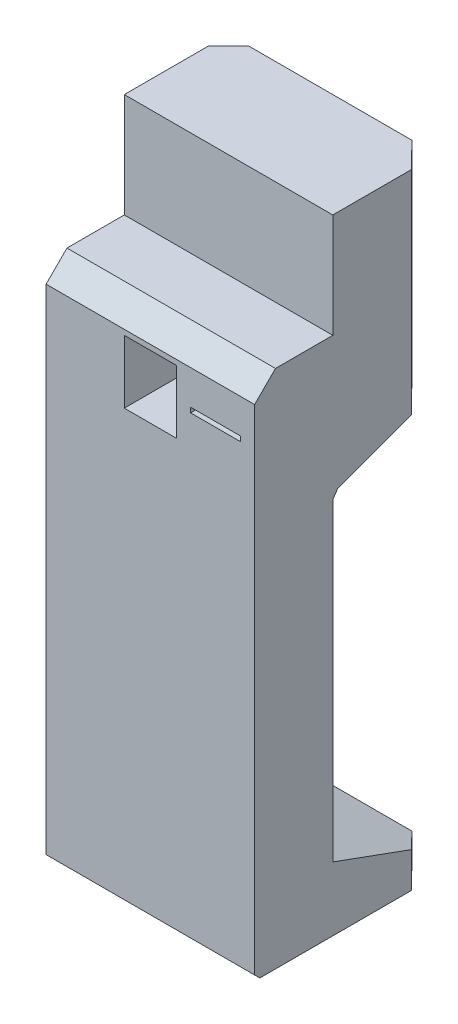
ISO-10303-21;
HEADER;
FILE_DESCRIPTION(('STEP AP214'),'2;1');
FILE_NAME('part.step','',(''),(''),'','','');
FILE_SCHEMA(('AUTOMOTIVE_DESIGN { 1 0 10303 214 1 1 1 1 }'));
ENDSEC;
DATA;
#1=APPLICATION_CONTEXT('core data for automotive mechanical design processes');
#2=APPLICATION_PROTOCOL_DEFINITION('international standard','automotive_design',2000,#1);
#3=PRODUCT_CONTEXT('',#1,'mechanical');
#4=PRODUCT('Part','Part','',(#3));
#5=PRODUCT_RELATED_PRODUCT_CATEGORY('part','',(#4));
#6=PRODUCT_DEFINITION_FORMATION('','',#4);
#7=PRODUCT_DEFINITION_CONTEXT('part definition',#1,'design');
#8=PRODUCT_DEFINITION('design','',#6,#7);
#9=PRODUCT_DEFINITION_SHAPE('','',#8);
#10=(LENGTH_UNIT() NAMED_UNIT(*) SI_UNIT(.MILLI.,.METRE.));
#11=(NAMED_UNIT(*) PLANE_ANGLE_UNIT() SI_UNIT($,.RADIAN.));
#12=(NAMED_UNIT(*) SI_UNIT($,.STERADIAN.) SOLID_ANGLE_UNIT());
#13=UNCERTAINTY_MEASURE_WITH_UNIT(LENGTH_MEASURE(1.E-05),#10,'distance_accuracy_value','');
#14=(GEOMETRIC_REPRESENTATION_CONTEXT(3) GLOBAL_UNCERTAINTY_ASSIGNED_CONTEXT((#13)) GLOBAL_UNIT_ASSIGNED_CONTEXT((#10,
#11,#12)) REPRESENTATION_CONTEXT('',''));
#15=CARTESIAN_POINT('',(0.,0.,0.));
#16=DIRECTION('',(0.,0.,1.));
#17=DIRECTION('',(1.,0.,0.));
#18=AXIS2_PLACEMENT_3D('',#15,#16,#17);
#19=CARTESIAN_POINT('',(400.,50.,0.));
#20=DIRECTION('',(0.,0.,1.));
#21=DIRECTION('',(0.,-1.,0.));
#22=AXIS2_PLACEMENT_3D('',#19,#20,#21);
#23=PLANE('',#22);
#24=DIRECTION('',(-1.,0.,0.));
#25=VECTOR('',#24,1.);
#26=CARTESIAN_POINT('',(400.,0.,0.));
#27=LINE('',#26,#25);
#28=CARTESIAN_POINT('',(351.734705208214,0.,0.));
#29=VERTEX_POINT('',#28);
#30=CARTESIAN_POINT('',(38.6420778551322,0.,0.));
#31=VERTEX_POINT('',#30);
#32=EDGE_CURVE('E281',#29,#31,#27,.T.);
#33=ORIENTED_EDGE('',*,*,#32,.T.);
#34=DIRECTION('',(0.,1.,0.));
#35=VECTOR('',#34,1.);
#36=CARTESIAN_POINT('',(38.6420778551322,50.0000000000001,0.));
#37=LINE('',#36,#35);
#38=CARTESIAN_POINT('',(38.6420778551323,50.,0.));
#39=VERTEX_POINT('',#38);
#40=EDGE_CURVE('E367',#31,#39,#37,.T.);
#41=ORIENTED_EDGE('',*,*,#40,.T.);
#42=DIRECTION('',(-1.,0.,0.));
#43=VECTOR('',#42,1.);
#44=CARTESIAN_POINT('',(400.,50.,0.));
#45=LINE('',#44,#43);
#46=CARTESIAN_POINT('',(351.734705208214,50.,0.));
#47=VERTEX_POINT('',#46);
#48=EDGE_CURVE('E248',#47,#39,#45,.T.);
#49=ORIENTED_EDGE('',*,*,#48,.F.);
#50=DIRECTION('',(0.,-1.,0.));
#51=VECTOR('',#50,1.);
#52=CARTESIAN_POINT('',(351.734705208214,50.,0.));
#53=LINE('',#52,#51);
#54=EDGE_CURVE('E368',#47,#29,#53,.T.);
#55=ORIENTED_EDGE('',*,*,#54,.T.);
#56=EDGE_LOOP('',(#33,#41,#49,#55));
#57=FACE_BOUND('',#56,.T.);
#58=ADVANCED_FACE('F33',(#57),#23,.F.);
#59=CARTESIAN_POINT('',(400.,50.,0.));
#60=DIRECTION('',(0.,-0.939692620785907,0.342020143325673));
#61=DIRECTION('',(0.,-0.342020143325673,-0.939692620785907));
#62=AXIS2_PLACEMENT_3D('',#59,#60,#61);
#63=PLANE('',#62);
#64=ORIENTED_EDGE('',*,*,#48,.T.);
#65=DIRECTION('',(-0.678775971324876,0.251160922277194,0.69005896260598));
#66=VECTOR('',#65,1.);
#67=CARTESIAN_POINT('',(205.132977514235,-11.6050209136324,-169.258403885233));
#68=LINE('',#67,#66);
#69=CARTESIAN_POINT('',(0.,64.2983551610683,39.284407940377));
#70=VERTEX_POINT('',#69);
#71=EDGE_CURVE('E376',#39,#70,#68,.T.);
#72=ORIENTED_EDGE('',*,*,#71,.T.);
#73=DIRECTION('',(0.,0.342020143325673,0.939692620785907));
#74=VECTOR('',#73,1.);
#75=CARTESIAN_POINT('',(0.,50.,0.));
#76=LINE('',#75,#74);
#77=CARTESIAN_POINT('',(0.,122.794046853241,200.));
#78=VERTEX_POINT('',#77);
#79=EDGE_CURVE('E282',#70,#78,#76,.T.);
#80=ORIENTED_EDGE('',*,*,#79,.T.);
#81=DIRECTION('',(-1.,0.,0.));
#82=VECTOR('',#81,1.);
#83=CARTESIAN_POINT('',(400.,122.794046853241,200.));
#84=LINE('',#83,#82);
#85=CARTESIAN_POINT('',(400.,122.794046853241,200.));
#86=VERTEX_POINT('',#85);
#87=EDGE_CURVE('E245',#86,#78,#84,.T.);
#88=ORIENTED_EDGE('',*,*,#87,.F.);
#89=DIRECTION('',(0.,0.342020143325673,0.939692620785907));
#90=VECTOR('',#89,1.);
#91=CARTESIAN_POINT('',(400.,50.,0.));
#92=LINE('',#91,#90);
#93=CARTESIAN_POINT('',(400.,67.8591412572024,49.0675873350135));
#94=VERTEX_POINT('',#93);
#95=EDGE_CURVE('E308',#94,#86,#92,.T.);
#96=ORIENTED_EDGE('',*,*,#95,.F.);
#97=DIRECTION('',(-0.678775971324876,-0.251160922277194,-0.690058962605979));
#98=VECTOR('',#97,1.);
#99=CARTESIAN_POINT('',(373.97230361065,58.2283639373447,22.607244116909));
#100=LINE('',#99,#98);
#101=EDGE_CURVE('E55',#94,#47,#100,.T.);
#102=ORIENTED_EDGE('',*,*,#101,.T.);
#103=EDGE_LOOP('',(#64,#72,#80,#88,#96,#102));
#104=FACE_BOUND('',#103,.T.);
#105=ADVANCED_FACE('F356',(#104),#63,.F.);
#106=CARTESIAN_POINT('',(400.,724.969611738019,200.));
#107=DIRECTION('',(0.,0.,1.));
#108=DIRECTION('',(0.,-1.,0.));
#109=AXIS2_PLACEMENT_3D('',#106,#107,#108);
#110=PLANE('',#109);
#111=DIRECTION('',(0.,1.,0.));
#112=VECTOR('',#111,1.);
#113=CARTESIAN_POINT('',(0.,724.969611738019,200.));
#114=LINE('',#113,#112);
#115=CARTESIAN_POINT('',(0.,724.969611738019,200.));
#116=VERTEX_POINT('',#115);
#117=EDGE_CURVE('E284',#78,#116,#114,.T.);
#118=ORIENTED_EDGE('',*,*,#117,.T.);
#119=DIRECTION('',(-1.,0.,0.));
#120=VECTOR('',#119,1.);
#121=CARTESIAN_POINT('',(400.,724.969611738019,200.));
#122=LINE('',#121,#120);
#123=CARTESIAN_POINT('',(400.,724.969611738019,200.));
#124=VERTEX_POINT('',#123);
#125=EDGE_CURVE('E242',#124,#116,#122,.T.);
#126=ORIENTED_EDGE('',*,*,#125,.F.);
#127=DIRECTION('',(0.,1.,0.));
#128=VECTOR('',#127,1.);
#129=CARTESIAN_POINT('',(400.,724.969611738019,200.));
#130=LINE('',#129,#128);
#131=EDGE_CURVE('E456',#86,#124,#130,.T.);
#132=ORIENTED_EDGE('',*,*,#131,.F.);
#133=ORIENTED_EDGE('',*,*,#87,.T.);
#134=EDGE_LOOP('',(#118,#126,#132,#133));
#135=FACE_BOUND('',#134,.T.);
#136=ADVANCED_FACE('F361',(#135),#110,.F.);
#137=CARTESIAN_POINT('',(400.,738.389813171275,190.603073792141));
#138=DIRECTION('',(0.,0.573576436351044,0.819152044288993));
#139=DIRECTION('',(0.,-0.819152044288993,0.573576436351044));
#140=AXIS2_PLACEMENT_3D('',#137,#138,#139);
#141=PLANE('',#140);
#142=DIRECTION('',(0.,0.819152044288993,-0.573576436351044));
#143=VECTOR('',#142,1.);
#144=CARTESIAN_POINT('',(0.,738.389813171275,190.603073792141));
#145=LINE('',#144,#143);
#146=CARTESIAN_POINT('',(0.,738.389813171275,190.603073792141));
#147=VERTEX_POINT('',#146);
#148=EDGE_CURVE('E287',#116,#147,#145,.T.);
#149=ORIENTED_EDGE('',*,*,#148,.T.);
#150=DIRECTION('',(-1.,0.,0.));
#151=VECTOR('',#150,1.);
#152=CARTESIAN_POINT('',(400.,738.389813171275,190.603073792141));
#153=LINE('',#152,#151);
#154=CARTESIAN_POINT('',(400.,738.389813171275,190.603073792141));
#155=VERTEX_POINT('',#154);
#156=EDGE_CURVE('E239',#155,#147,#153,.T.);
#157=ORIENTED_EDGE('',*,*,#156,.F.);
#158=DIRECTION('',(0.,0.819152044288993,-0.573576436351044));
#159=VECTOR('',#158,1.);
#160=CARTESIAN_POINT('',(400.,738.389813171275,190.603073792141));
#161=LINE('',#160,#159);
#162=EDGE_CURVE('E268',#124,#155,#161,.T.);
#163=ORIENTED_EDGE('',*,*,#162,.F.);
#164=ORIENTED_EDGE('',*,*,#125,.T.);
#165=EDGE_LOOP('',(#149,#157,#163,#164));
#166=FACE_BOUND('',#165,.T.);
#167=ADVANCED_FACE('F462',(#166),#141,.F.);
#168=CARTESIAN_POINT('',(400.,804.343457158002,9.39692620785916));
#169=DIRECTION('',(0.,0.939692620785909,0.342020143325667));
#170=DIRECTION('',(0.,-0.342020143325667,0.939692620785909));
#171=AXIS2_PLACEMENT_3D('',#168,#169,#170);
#172=PLANE('',#171);
#173=DIRECTION('',(0.,0.342020143325667,-0.939692620785909));
#174=VECTOR('',#173,1.);
#175=CARTESIAN_POINT('',(0.,804.343457158002,9.39692620785916));
#176=LINE('',#175,#174);
#177=CARTESIAN_POINT('',(0.,793.465303430191,39.284407940377));
#178=VERTEX_POINT('',#177);
#179=EDGE_CURVE('E290',#147,#178,#176,.T.);
#180=ORIENTED_EDGE('',*,*,#179,.T.);
#181=DIRECTION('',(0.678775971324877,0.25116092227719,-0.69005896260598));
#182=VECTOR('',#181,1.);
#183=CARTESIAN_POINT('',(200.148417326644,867.52429080118,-164.190987569091));
#184=LINE('',#183,#182);
#185=CARTESIAN_POINT('',(29.3987985705332,804.343457158002,9.39692620785915));
#186=VERTEX_POINT('',#185);
#187=EDGE_CURVE('E213',#178,#186,#184,.T.);
#188=ORIENTED_EDGE('',*,*,#187,.T.);
#189=DIRECTION('',(-1.,0.,0.));
#190=VECTOR('',#189,1.);
#191=CARTESIAN_POINT('',(400.,804.343457158002,9.39692620785916));
#192=LINE('',#191,#190);
#193=CARTESIAN_POINT('',(360.977984492813,804.343457158002,9.39692620785916));
#194=VERTEX_POINT('',#193);
#195=EDGE_CURVE('E230',#194,#186,#192,.T.);
#196=ORIENTED_EDGE('',*,*,#195,.F.);
#197=DIRECTION('',(0.678775971324877,-0.25116092227719,0.69005896260598));
#198=VECTOR('',#197,1.);
#199=CARTESIAN_POINT('',(378.956863798241,797.690905950204,27.6746604330507));
#200=LINE('',#199,#198);
#201=CARTESIAN_POINT('',(400.,789.904517334057,49.0675873350135));
#202=VERTEX_POINT('',#201);
#203=EDGE_CURVE('E382',#194,#202,#200,.T.);
#204=ORIENTED_EDGE('',*,*,#203,.T.);
#205=DIRECTION('',(0.,0.342020143325667,-0.939692620785909));
#206=VECTOR('',#205,1.);
#207=CARTESIAN_POINT('',(400.,797.763658591259,27.4747741945463));
#208=LINE('',#207,#206);
#209=EDGE_CURVE('E261',#155,#202,#208,.T.);
#210=ORIENTED_EDGE('',*,*,#209,.F.);
#211=ORIENTED_EDGE('',*,*,#156,.T.);
#212=EDGE_LOOP('',(#180,#188,#196,#204,#210,#211));
#213=FACE_BOUND('',#212,.T.);
#214=ADVANCED_FACE('F465',(#213),#172,.F.);
#215=CARTESIAN_POINT('',(400.,817.763658591259,0.));
#216=DIRECTION('',(0.,0.573576436351051,0.819152044288988));
#217=DIRECTION('',(0.,-0.819152044288988,0.573576436351051));
#218=AXIS2_PLACEMENT_3D('',#215,#216,#217);
#219=PLANE('',#218);
#220=ORIENTED_EDGE('',*,*,#195,.T.);
#221=DIRECTION('',(0.491384255613947,0.7134346467771,-0.499552317693314));
#222=VECTOR('',#221,1.);
#223=CARTESIAN_POINT('',(125.89501488074,944.445105129168,-88.7033038171558));
#224=LINE('',#223,#222);
#225=CARTESIAN_POINT('',(38.6420778551323,817.763658591259,0.));
#226=VERTEX_POINT('',#225);
#227=EDGE_CURVE('E224',#186,#226,#224,.T.);
#228=ORIENTED_EDGE('',*,*,#227,.T.);
#229=DIRECTION('',(-1.,0.,0.));
#230=VECTOR('',#229,1.);
#231=CARTESIAN_POINT('',(400.,817.763658591259,0.));
#232=LINE('',#231,#230);
#233=CARTESIAN_POINT('',(351.734705208214,817.763658591259,0.));
#234=VERTEX_POINT('',#233);
#235=EDGE_CURVE('E222',#234,#226,#232,.T.);
#236=ORIENTED_EDGE('',*,*,#235,.F.);
#237=DIRECTION('',(0.491384255613947,-0.7134346467771,0.499552317693314));
#238=VECTOR('',#237,1.);
#239=CARTESIAN_POINT('',(363.388770247092,800.843267513321,11.8477853822285));
#240=LINE('',#239,#238);
#241=EDGE_CURVE('E384',#234,#194,#240,.T.);
#242=ORIENTED_EDGE('',*,*,#241,.T.);
#243=EDGE_LOOP('',(#220,#228,#236,#242));
#244=FACE_BOUND('',#243,.T.);
#245=ADVANCED_FACE('F470',(#244),#219,.F.);
#246=CARTESIAN_POINT('',(400.,997.763658591259,0.));
#247=DIRECTION('',(0.,0.,1.));
#248=DIRECTION('',(0.,-1.,0.));
#249=AXIS2_PLACEMENT_3D('',#246,#247,#248);
#250=PLANE('',#249);
#251=ORIENTED_EDGE('',*,*,#235,.T.);
#252=DIRECTION('',(0.,1.,0.));
#253=VECTOR('',#252,1.);
#254=CARTESIAN_POINT('',(38.6420778551322,997.763658591259,0.));
#255=LINE('',#254,#253);
#256=CARTESIAN_POINT('',(38.6420778551323,1197.76365859126,0.));
#257=VERTEX_POINT('',#256);
#258=EDGE_CURVE('E206',#226,#257,#255,.T.);
#259=ORIENTED_EDGE('',*,*,#258,.T.);
#260=DIRECTION('',(-1.,0.,0.));
#261=VECTOR('',#260,1.);
#262=CARTESIAN_POINT('',(400.,1197.76365859126,0.));
#263=LINE('',#262,#261);
#264=CARTESIAN_POINT('',(351.734705208214,1197.76365859126,0.));
#265=VERTEX_POINT('',#264);
#266=EDGE_CURVE('E220',#265,#257,#263,.T.);
#267=ORIENTED_EDGE('',*,*,#266,.F.);
#268=DIRECTION('',(0.,-1.,0.));
#269=VECTOR('',#268,1.);
#270=CARTESIAN_POINT('',(351.734705208214,997.763658591259,0.));
#271=LINE('',#270,#269);
#272=EDGE_CURVE('E387',#265,#234,#271,.T.);
#273=ORIENTED_EDGE('',*,*,#272,.T.);
#274=EDGE_LOOP('',(#251,#259,#267,#273));
#275=FACE_BOUND('',#274,.T.);
#276=ADVANCED_FACE('F218',(#275),#250,.F.);
#277=CARTESIAN_POINT('',(400.,1197.76365859126,200.));
#278=DIRECTION('',(0.,-1.,0.));
#279=DIRECTION('',(0.,0.,-1.));
#280=AXIS2_PLACEMENT_3D('',#277,#278,#279);
#281=PLANE('',#280);
#282=ORIENTED_EDGE('',*,*,#266,.T.);
#283=DIRECTION('',(-0.701254440401762,0.,0.712911081283502));
#284=VECTOR('',#283,1.);
#285=CARTESIAN_POINT('',(-32.9719100035619,1197.76365859126,72.804395349162));
#286=LINE('',#285,#284);
#287=CARTESIAN_POINT('',(0.,1197.76365859126,39.284407940377));
#288=VERTEX_POINT('',#287);
#289=EDGE_CURVE('E203',#257,#288,#286,.T.);
#290=ORIENTED_EDGE('',*,*,#289,.T.);
#291=DIRECTION('',(0.,0.,1.));
#292=VECTOR('',#291,1.);
#293=CARTESIAN_POINT('',(0.,1197.76365859126,200.));
#294=LINE('',#293,#292);
#295=CARTESIAN_POINT('',(0.,1197.76365859126,200.));
#296=VERTEX_POINT('',#295);
#297=EDGE_CURVE('E293',#288,#296,#294,.T.);
#298=ORIENTED_EDGE('',*,*,#297,.T.);
#299=DIRECTION('',(-1.,0.,0.));
#300=VECTOR('',#299,1.);
#301=CARTESIAN_POINT('',(400.,1197.76365859126,200.));
#302=LINE('',#301,#300);
#303=CARTESIAN_POINT('',(400.,1197.76365859126,200.));
#304=VERTEX_POINT('',#303);
#305=EDGE_CURVE('E228',#304,#296,#302,.T.);
#306=ORIENTED_EDGE('',*,*,#305,.F.);
#307=DIRECTION('',(0.,0.,1.));
#308=VECTOR('',#307,1.);
#309=CARTESIAN_POINT('',(400.,1197.76365859126,0.));
#310=LINE('',#309,#308);
#311=CARTESIAN_POINT('',(400.,1197.76365859126,49.0675873350135));
#312=VERTEX_POINT('',#311);
#313=EDGE_CURVE('E258',#312,#304,#310,.T.);
#314=ORIENTED_EDGE('',*,*,#313,.F.);
#315=DIRECTION('',(-0.701254440401762,0.,-0.712911081283502));
#316=VECTOR('',#315,1.);
#317=CARTESIAN_POINT('',(322.648629758769,1197.76365859126,-29.5695603539813));
#318=LINE('',#317,#316);
#319=EDGE_CURVE('E47',#312,#265,#318,.T.);
#320=ORIENTED_EDGE('',*,*,#319,.T.);
#321=EDGE_LOOP('',(#282,#290,#298,#306,#314,#320));
#322=FACE_BOUND('',#321,.T.);
#323=ADVANCED_FACE('F226',(#322),#281,.F.);
#324=CARTESIAN_POINT('',(400.,997.763658591259,200.));
#325=DIRECTION('',(0.,0.,-1.));
#326=DIRECTION('',(-1.,0.,0.));
#327=AXIS2_PLACEMENT_3D('',#324,#325,#326);
#328=PLANE('',#327);
#329=DIRECTION('',(0.,-1.,0.));
#330=VECTOR('',#329,1.);
#331=CARTESIAN_POINT('',(0.,997.763658591259,200.));
#332=LINE('',#331,#330);
#333=CARTESIAN_POINT('',(0.,997.763658591259,200.));
#334=VERTEX_POINT('',#333);
#335=EDGE_CURVE('E295',#296,#334,#332,.T.);
#336=ORIENTED_EDGE('',*,*,#335,.T.);
#337=DIRECTION('',(-1.,0.,0.));
#338=VECTOR('',#337,1.);
#339=CARTESIAN_POINT('',(400.,997.763658591259,200.));
#340=LINE('',#339,#338);
#341=CARTESIAN_POINT('',(400.,997.763658591259,200.));
#342=VERTEX_POINT('',#341);
#343=EDGE_CURVE('E233',#342,#334,#340,.T.);
#344=ORIENTED_EDGE('',*,*,#343,.F.);
#345=DIRECTION('',(0.,-1.,0.));
#346=VECTOR('',#345,1.);
#347=CARTESIAN_POINT('',(400.,997.763658591259,200.));
#348=LINE('',#347,#346);
#349=EDGE_CURVE('E264',#304,#342,#348,.T.);
#350=ORIENTED_EDGE('',*,*,#349,.F.);
#351=ORIENTED_EDGE('',*,*,#305,.T.);
#352=EDGE_LOOP('',(#336,#344,#350,#351));
#353=FACE_BOUND('',#352,.T.);
#354=ADVANCED_FACE('F346',(#353),#328,.F.);
#355=CARTESIAN_POINT('',(400.,997.763658591259,310.));
#356=DIRECTION('',(0.,-1.,0.));
#357=DIRECTION('',(0.,0.,-1.));
#358=AXIS2_PLACEMENT_3D('',#355,#356,#357);
#359=PLANE('',#358);
#360=DIRECTION('',(0.,0.,1.));
#361=VECTOR('',#360,1.);
#362=CARTESIAN_POINT('',(0.,997.763658591259,310.));
#363=LINE('',#362,#361);
#364=CARTESIAN_POINT('',(0.,997.763658591259,310.));
#365=VERTEX_POINT('',#364);
#366=EDGE_CURVE('E297',#334,#365,#363,.T.);
#367=ORIENTED_EDGE('',*,*,#366,.T.);
#368=DIRECTION('',(-1.,0.,0.));
#369=VECTOR('',#368,1.);
#370=CARTESIAN_POINT('',(400.,997.763658591259,310.));
#371=LINE('',#370,#369);
#372=CARTESIAN_POINT('',(400.,997.763658591259,310.));
#373=VERTEX_POINT('',#372);
#374=EDGE_CURVE('E320',#373,#365,#371,.T.);
#375=ORIENTED_EDGE('',*,*,#374,.F.);
#376=DIRECTION('',(0.,0.,1.));
#377=VECTOR('',#376,1.);
#378=CARTESIAN_POINT('',(400.,997.763658591259,310.));
#379=LINE('',#378,#377);
#380=EDGE_CURVE('E266',#342,#373,#379,.T.);
#381=ORIENTED_EDGE('',*,*,#380,.F.);
#382=ORIENTED_EDGE('',*,*,#343,.T.);
#383=EDGE_LOOP('',(#367,#375,#381,#382));
#384=FACE_BOUND('',#383,.T.);
#385=ADVANCED_FACE('F327',(#384),#359,.F.);
#386=CARTESIAN_POINT('',(400.,997.763658591259,310.));
#387=DIRECTION('',(0.,-0.707106781186547,-0.707106781186549));
#388=DIRECTION('',(0.,0.707106781186549,-0.707106781186547));
#389=AXIS2_PLACEMENT_3D('',#386,#387,#388);
#390=PLANE('',#389);
#391=DIRECTION('',(0.,-0.707106781186549,0.707106781186547));
#392=VECTOR('',#391,1.);
#393=CARTESIAN_POINT('',(0.,997.763658591259,310.));
#394=LINE('',#393,#392);
#395=CARTESIAN_POINT('',(0.,957.763658591259,350.));
#396=VERTEX_POINT('',#395);
#397=EDGE_CURVE('E299',#365,#396,#394,.T.);
#398=ORIENTED_EDGE('',*,*,#397,.T.);
#399=DIRECTION('',(-1.,0.,0.));
#400=VECTOR('',#399,1.);
#401=CARTESIAN_POINT('',(400.,957.763658591259,350.));
#402=LINE('',#401,#400);
#403=CARTESIAN_POINT('',(400.,957.763658591259,350.));
#404=VERTEX_POINT('',#403);
#405=EDGE_CURVE('E317',#404,#396,#402,.T.);
#406=ORIENTED_EDGE('',*,*,#405,.F.);
#407=DIRECTION('',(0.,-0.707106781186549,0.707106781186547));
#408=VECTOR('',#407,1.);
#409=CARTESIAN_POINT('',(400.,997.763658591259,310.));
#410=LINE('',#409,#408);
#411=EDGE_CURVE('E273',#373,#404,#410,.T.);
#412=ORIENTED_EDGE('',*,*,#411,.F.);
#413=ORIENTED_EDGE('',*,*,#374,.T.);
#414=EDGE_LOOP('',(#398,#406,#412,#413));
#415=FACE_BOUND('',#414,.T.);
#416=ADVANCED_FACE('F338',(#415),#390,.F.);
#417=CARTESIAN_POINT('',(400.,9.99999999999996,350.));
#418=DIRECTION('',(0.,0.,-1.));
#419=DIRECTION('',(0.,1.,0.));
#420=AXIS2_PLACEMENT_3D('',#417,#418,#419);
#421=PLANE('',#420);
#422=DIRECTION('',(-1.,0.,0.));
#423=VECTOR('',#422,1.);
#424=CARTESIAN_POINT('',(372.65,891.963658591259,350.));
#425=LINE('',#424,#423);
#426=CARTESIAN_POINT('',(372.65,891.963658591259,350.));
#427=VERTEX_POINT('',#426);
#428=CARTESIAN_POINT('',(277.35,891.963658591259,350.));
#429=VERTEX_POINT('',#428);
#430=EDGE_CURVE('E408',#427,#429,#425,.T.);
#431=ORIENTED_EDGE('',*,*,#430,.F.);
#432=DIRECTION('',(0.,1.,0.));
#433=VECTOR('',#432,1.);
#434=CARTESIAN_POINT('',(372.65,891.963658591259,350.));
#435=LINE('',#434,#433);
#436=CARTESIAN_POINT('',(372.65,882.563658591259,350.));
#437=VERTEX_POINT('',#436);
#438=EDGE_CURVE('E392',#437,#427,#435,.T.);
#439=ORIENTED_EDGE('',*,*,#438,.F.);
#440=DIRECTION('',(1.,0.,0.));
#441=VECTOR('',#440,1.);
#442=CARTESIAN_POINT('',(372.65,882.563658591259,350.));
#443=LINE('',#442,#441);
#444=CARTESIAN_POINT('',(277.35,882.563658591259,350.));
#445=VERTEX_POINT('',#444);
#446=EDGE_CURVE('E397',#445,#437,#443,.T.);
#447=ORIENTED_EDGE('',*,*,#446,.F.);
#448=DIRECTION('',(0.,-1.,0.));
#449=VECTOR('',#448,1.);
#450=CARTESIAN_POINT('',(277.35,891.963658591259,350.));
#451=LINE('',#450,#449);
#452=EDGE_CURVE('E411',#429,#445,#451,.T.);
#453=ORIENTED_EDGE('',*,*,#452,.F.);
#454=EDGE_LOOP('',(#431,#439,#447,#453));
#455=FACE_BOUND('',#454,.T.);
#456=DIRECTION('',(1.,0.,0.));
#457=VECTOR('',#456,1.);
#458=CARTESIAN_POINT('',(150.,826.763658591259,350.));
#459=LINE('',#458,#457);
#460=CARTESIAN_POINT('',(150.,826.763658591259,350.));
#461=VERTEX_POINT('',#460);
#462=CARTESIAN_POINT('',(250.,826.763658591259,350.));
#463=VERTEX_POINT('',#462);
#464=EDGE_CURVE('E440',#461,#463,#459,.T.);
#465=ORIENTED_EDGE('',*,*,#464,.F.);
#466=DIRECTION('',(0.,-1.,0.));
#467=VECTOR('',#466,1.);
#468=CARTESIAN_POINT('',(150.,947.763658591259,350.));
#469=LINE('',#468,#467);
#470=CARTESIAN_POINT('',(150.,947.763658591259,350.));
#471=VERTEX_POINT('',#470);
#472=EDGE_CURVE('E418',#471,#461,#469,.T.);
#473=ORIENTED_EDGE('',*,*,#472,.F.);
#474=DIRECTION('',(-1.,0.,0.));
#475=VECTOR('',#474,1.);
#476=CARTESIAN_POINT('',(150.,947.763658591259,350.));
#477=LINE('',#476,#475);
#478=CARTESIAN_POINT('',(250.,947.763658591259,350.));
#479=VERTEX_POINT('',#478);
#480=EDGE_CURVE('E429',#479,#471,#477,.T.);
#481=ORIENTED_EDGE('',*,*,#480,.F.);
#482=DIRECTION('',(0.,1.,0.));
#483=VECTOR('',#482,1.);
#484=CARTESIAN_POINT('',(250.,947.763658591259,350.));
#485=LINE('',#484,#483);
#486=EDGE_CURVE('E443',#463,#479,#485,.T.);
#487=ORIENTED_EDGE('',*,*,#486,.F.);
#488=EDGE_LOOP('',(#465,#473,#481,#487));
#489=FACE_BOUND('',#488,.T.);
#490=DIRECTION('',(0.,-1.,0.));
#491=VECTOR('',#490,1.);
#492=CARTESIAN_POINT('',(0.,9.99999999999996,350.));
#493=LINE('',#492,#491);
#494=CARTESIAN_POINT('',(0.,9.99999999999996,350.));
#495=VERTEX_POINT('',#494);
#496=EDGE_CURVE('E301',#396,#495,#493,.T.);
#497=ORIENTED_EDGE('',*,*,#496,.T.);
#498=DIRECTION('',(-1.,0.,0.));
#499=VECTOR('',#498,1.);
#500=CARTESIAN_POINT('',(400.,9.99999999999996,350.));
#501=LINE('',#500,#499);
#502=CARTESIAN_POINT('',(400.,9.99999999999996,350.));
#503=VERTEX_POINT('',#502);
#504=EDGE_CURVE('E314',#503,#495,#501,.T.);
#505=ORIENTED_EDGE('',*,*,#504,.F.);
#506=DIRECTION('',(0.,-1.,0.));
#507=VECTOR('',#506,1.);
#508=CARTESIAN_POINT('',(400.,9.99999999999996,350.));
#509=LINE('',#508,#507);
#510=EDGE_CURVE('E275',#404,#503,#509,.T.);
#511=ORIENTED_EDGE('',*,*,#510,.F.);
#512=ORIENTED_EDGE('',*,*,#405,.T.);
#513=EDGE_LOOP('',(#497,#505,#511,#512));
#514=FACE_BOUND('',#513,.T.);
#515=ADVANCED_FACE('F342',(#455,#489,#514),#421,.F.);
#516=CARTESIAN_POINT('',(400.,0.,340.));
#517=DIRECTION('',(0.,0.707106781186548,-0.707106781186547));
#518=DIRECTION('',(0.,0.707106781186547,0.707106781186548));
#519=AXIS2_PLACEMENT_3D('',#516,#517,#518);
#520=PLANE('',#519);
#521=DIRECTION('',(0.,-0.707106781186547,-0.707106781186548));
#522=VECTOR('',#521,1.);
#523=CARTESIAN_POINT('',(0.,0.,340.));
#524=LINE('',#523,#522);
#525=CARTESIAN_POINT('',(0.,0.,340.));
#526=VERTEX_POINT('',#525);
#527=EDGE_CURVE('E303',#495,#526,#524,.T.);
#528=ORIENTED_EDGE('',*,*,#527,.T.);
#529=DIRECTION('',(-1.,0.,0.));
#530=VECTOR('',#529,1.);
#531=CARTESIAN_POINT('',(400.,0.,340.));
#532=LINE('',#531,#530);
#533=CARTESIAN_POINT('',(400.,0.,340.));
#534=VERTEX_POINT('',#533);
#535=EDGE_CURVE('E311',#534,#526,#532,.T.);
#536=ORIENTED_EDGE('',*,*,#535,.F.);
#537=DIRECTION('',(0.,-0.707106781186547,-0.707106781186548));
#538=VECTOR('',#537,1.);
#539=CARTESIAN_POINT('',(400.,0.,340.));
#540=LINE('',#539,#538);
#541=EDGE_CURVE('E277',#503,#534,#540,.T.);
#542=ORIENTED_EDGE('',*,*,#541,.F.);
#543=ORIENTED_EDGE('',*,*,#504,.T.);
#544=EDGE_LOOP('',(#528,#536,#542,#543));
#545=FACE_BOUND('',#544,.T.);
#546=ADVANCED_FACE('F535',(#545),#520,.F.);
#547=CARTESIAN_POINT('',(400.,0.,0.));
#548=DIRECTION('',(0.,1.,0.));
#549=DIRECTION('',(0.,0.,1.));
#550=AXIS2_PLACEMENT_3D('',#547,#548,#549);
#551=PLANE('',#550);
#552=DIRECTION('',(0.,0.,-1.));
#553=VECTOR('',#552,1.);
#554=CARTESIAN_POINT('',(0.,0.,0.));
#555=LINE('',#554,#553);
#556=CARTESIAN_POINT('',(0.,0.,39.284407940377));
#557=VERTEX_POINT('',#556);
#558=EDGE_CURVE('E305',#526,#557,#555,.T.);
#559=ORIENTED_EDGE('',*,*,#558,.T.);
#560=DIRECTION('',(0.701254440401762,0.,-0.712911081283502));
#561=VECTOR('',#560,1.);
#562=CARTESIAN_POINT('',(216.342651114281,0.,-180.654410907256));
#563=LINE('',#562,#561);
#564=EDGE_CURVE('E223',#557,#31,#563,.T.);
#565=ORIENTED_EDGE('',*,*,#564,.T.);
#566=ORIENTED_EDGE('',*,*,#32,.F.);
#567=DIRECTION('',(0.701254440401762,0.,0.712911081283502));
#568=VECTOR('',#567,1.);
#569=CARTESIAN_POINT('',(375.469539917563,0.,24.1293683174868));
#570=LINE('',#569,#568);
#571=CARTESIAN_POINT('',(400.,0.,49.0675873350135));
#572=VERTEX_POINT('',#571);
#573=EDGE_CURVE('E374',#29,#572,#570,.T.);
#574=ORIENTED_EDGE('',*,*,#573,.T.);
#575=DIRECTION('',(0.,0.,-1.));
#576=VECTOR('',#575,1.);
#577=CARTESIAN_POINT('',(400.,0.,0.));
#578=LINE('',#577,#576);
#579=EDGE_CURVE('E279',#534,#572,#578,.T.);
#580=ORIENTED_EDGE('',*,*,#579,.F.);
#581=ORIENTED_EDGE('',*,*,#535,.T.);
#582=EDGE_LOOP('',(#559,#565,#566,#574,#580,#581));
#583=FACE_BOUND('',#582,.T.);
#584=ADVANCED_FACE('F372',(#583),#551,.F.);
#585=CARTESIAN_POINT('',(400.,0.,0.));
#586=DIRECTION('',(-1.,0.,0.));
#587=DIRECTION('',(0.,0.,1.));
#588=AXIS2_PLACEMENT_3D('',#585,#586,#587);
#589=PLANE('',#588);
#590=ORIENTED_EDGE('',*,*,#579,.T.);
#591=DIRECTION('',(0.,1.,0.));
#592=VECTOR('',#591,1.);
#593=CARTESIAN_POINT('',(400.,0.,49.0675873350135));
#594=LINE('',#593,#592);
#595=EDGE_CURVE('E11',#572,#94,#594,.T.);
#596=ORIENTED_EDGE('',*,*,#595,.T.);
#597=ORIENTED_EDGE('',*,*,#95,.T.);
#598=ORIENTED_EDGE('',*,*,#131,.T.);
#599=ORIENTED_EDGE('',*,*,#162,.T.);
#600=ORIENTED_EDGE('',*,*,#209,.T.);
#601=EDGE_CURVE('E36',#202,#312,#594,.T.);
#602=ORIENTED_EDGE('',*,*,#601,.T.);
#603=ORIENTED_EDGE('',*,*,#313,.T.);
#604=ORIENTED_EDGE('',*,*,#349,.T.);
#605=ORIENTED_EDGE('',*,*,#380,.T.);
#606=ORIENTED_EDGE('',*,*,#411,.T.);
#607=ORIENTED_EDGE('',*,*,#510,.T.);
#608=ORIENTED_EDGE('',*,*,#541,.T.);
#609=EDGE_LOOP('',(#590,#596,#597,#598,#599,#600,#602,#603,#604,#605,#606,#607,#608));
#610=FACE_BOUND('',#609,.T.);
#611=ADVANCED_FACE('F257',(#610),#589,.F.);
#612=CARTESIAN_POINT('',(0.,0.,0.));
#613=DIRECTION('',(-1.,0.,0.));
#614=DIRECTION('',(0.,0.,1.));
#615=AXIS2_PLACEMENT_3D('',#612,#613,#614);
#616=PLANE('',#615);
#617=DIRECTION('',(0.,1.,0.));
#618=VECTOR('',#617,1.);
#619=CARTESIAN_POINT('',(0.,0.,39.284407940377));
#620=LINE('',#619,#618);
#621=EDGE_CURVE('E250',#557,#70,#620,.T.);
#622=ORIENTED_EDGE('',*,*,#621,.F.);
#623=ORIENTED_EDGE('',*,*,#558,.F.);
#624=ORIENTED_EDGE('',*,*,#527,.F.);
#625=ORIENTED_EDGE('',*,*,#496,.F.);
#626=ORIENTED_EDGE('',*,*,#397,.F.);
#627=ORIENTED_EDGE('',*,*,#366,.F.);
#628=ORIENTED_EDGE('',*,*,#335,.F.);
#629=ORIENTED_EDGE('',*,*,#297,.F.);
#630=EDGE_CURVE('E209',#178,#288,#620,.T.);
#631=ORIENTED_EDGE('',*,*,#630,.F.);
#632=ORIENTED_EDGE('',*,*,#179,.F.);
#633=ORIENTED_EDGE('',*,*,#148,.F.);
#634=ORIENTED_EDGE('',*,*,#117,.F.);
#635=ORIENTED_EDGE('',*,*,#79,.F.);
#636=EDGE_LOOP('',(#622,#623,#624,#625,#626,#627,#628,#629,#631,#632,#633,#634,#635));
#637=FACE_BOUND('',#636,.T.);
#638=ADVANCED_FACE('F333',(#637),#616,.T.);
#639=CARTESIAN_POINT('',(150.,947.763658591259,81.9999999999999));
#640=DIRECTION('',(-1.,0.,0.));
#641=DIRECTION('',(0.,-1.,0.));
#642=AXIS2_PLACEMENT_3D('',#639,#640,#641);
#643=PLANE('',#642);
#644=ORIENTED_EDGE('',*,*,#472,.T.);
#645=DIRECTION('',(0.,0.,1.));
#646=VECTOR('',#645,1.);
#647=CARTESIAN_POINT('',(150.,826.763658591259,81.9999999999999));
#648=LINE('',#647,#646);
#649=CARTESIAN_POINT('',(150.,826.763658591259,81.9999999999999));
#650=VERTEX_POINT('',#649);
#651=EDGE_CURVE('E438',#650,#461,#648,.T.);
#652=ORIENTED_EDGE('',*,*,#651,.F.);
#653=DIRECTION('',(0.,-1.,0.));
#654=VECTOR('',#653,1.);
#655=CARTESIAN_POINT('',(150.,947.763658591259,81.9999999999999));
#656=LINE('',#655,#654);
#657=CARTESIAN_POINT('',(150.,947.763658591259,81.9999999999999));
#658=VERTEX_POINT('',#657);
#659=EDGE_CURVE('E425',#658,#650,#656,.T.);
#660=ORIENTED_EDGE('',*,*,#659,.F.);
#661=DIRECTION('',(0.,0.,1.));
#662=VECTOR('',#661,1.);
#663=CARTESIAN_POINT('',(150.,947.763658591259,81.9999999999999));
#664=LINE('',#663,#662);
#665=EDGE_CURVE('E285',#658,#471,#664,.T.);
#666=ORIENTED_EDGE('',*,*,#665,.T.);
#667=EDGE_LOOP('',(#644,#652,#660,#666));
#668=FACE_BOUND('',#667,.T.);
#669=ADVANCED_FACE('F518',(#668),#643,.F.);
#670=CARTESIAN_POINT('',(150.,947.763658591259,81.9999999999999));
#671=DIRECTION('',(0.,1.,0.));
#672=DIRECTION('',(0.,0.,1.));
#673=AXIS2_PLACEMENT_3D('',#670,#671,#672);
#674=PLANE('',#673);
#675=ORIENTED_EDGE('',*,*,#480,.T.);
#676=ORIENTED_EDGE('',*,*,#665,.F.);
#677=DIRECTION('',(-1.,0.,0.));
#678=VECTOR('',#677,1.);
#679=CARTESIAN_POINT('',(150.,947.763658591259,81.9999999999999));
#680=LINE('',#679,#678);
#681=CARTESIAN_POINT('',(250.,947.763658591259,81.9999999999999));
#682=VERTEX_POINT('',#681);
#683=EDGE_CURVE('E435',#682,#658,#680,.T.);
#684=ORIENTED_EDGE('',*,*,#683,.F.);
#685=DIRECTION('',(0.,0.,1.));
#686=VECTOR('',#685,1.);
#687=CARTESIAN_POINT('',(250.,947.763658591259,81.9999999999999));
#688=LINE('',#687,#686);
#689=EDGE_CURVE('E449',#682,#479,#688,.T.);
#690=ORIENTED_EDGE('',*,*,#689,.T.);
#691=EDGE_LOOP('',(#675,#676,#684,#690));
#692=FACE_BOUND('',#691,.T.);
#693=ADVANCED_FACE('F514',(#692),#674,.F.);
#694=CARTESIAN_POINT('',(250.,947.763658591259,81.9999999999999));
#695=DIRECTION('',(1.,0.,0.));
#696=DIRECTION('',(0.,1.,0.));
#697=AXIS2_PLACEMENT_3D('',#694,#695,#696);
#698=PLANE('',#697);
#699=ORIENTED_EDGE('',*,*,#486,.T.);
#700=ORIENTED_EDGE('',*,*,#689,.F.);
#701=DIRECTION('',(0.,1.,0.));
#702=VECTOR('',#701,1.);
#703=CARTESIAN_POINT('',(250.,947.763658591259,81.9999999999999));
#704=LINE('',#703,#702);
#705=CARTESIAN_POINT('',(250.,826.763658591259,81.9999999999999));
#706=VERTEX_POINT('',#705);
#707=EDGE_CURVE('E432',#706,#682,#704,.T.);
#708=ORIENTED_EDGE('',*,*,#707,.F.);
#709=DIRECTION('',(0.,0.,1.));
#710=VECTOR('',#709,1.);
#711=CARTESIAN_POINT('',(250.,826.763658591259,81.9999999999999));
#712=LINE('',#711,#710);
#713=EDGE_CURVE('E451',#706,#463,#712,.T.);
#714=ORIENTED_EDGE('',*,*,#713,.T.);
#715=EDGE_LOOP('',(#699,#700,#708,#714));
#716=FACE_BOUND('',#715,.T.);
#717=ADVANCED_FACE('F517',(#716),#698,.F.);
#718=CARTESIAN_POINT('',(150.,826.763658591259,81.9999999999999));
#719=DIRECTION('',(0.,-1.,0.));
#720=DIRECTION('',(0.,0.,-1.));
#721=AXIS2_PLACEMENT_3D('',#718,#719,#720);
#722=PLANE('',#721);
#723=ORIENTED_EDGE('',*,*,#464,.T.);
#724=ORIENTED_EDGE('',*,*,#713,.F.);
#725=DIRECTION('',(1.,0.,0.));
#726=VECTOR('',#725,1.);
#727=CARTESIAN_POINT('',(150.,826.763658591259,81.9999999999999));
#728=LINE('',#727,#726);
#729=EDGE_CURVE('E428',#650,#706,#728,.T.);
#730=ORIENTED_EDGE('',*,*,#729,.F.);
#731=ORIENTED_EDGE('',*,*,#651,.T.);
#732=EDGE_LOOP('',(#723,#724,#730,#731));
#733=FACE_BOUND('',#732,.T.);
#734=ADVANCED_FACE('F512',(#733),#722,.F.);
#735=CARTESIAN_POINT('',(0.,0.,81.9999999999999));
#736=DIRECTION('',(0.,0.,1.));
#737=DIRECTION('',(1.,0.,0.));
#738=AXIS2_PLACEMENT_3D('',#735,#736,#737);
#739=PLANE('',#738);
#740=ORIENTED_EDGE('',*,*,#659,.T.);
#741=ORIENTED_EDGE('',*,*,#729,.T.);
#742=ORIENTED_EDGE('',*,*,#707,.T.);
#743=ORIENTED_EDGE('',*,*,#683,.T.);
#744=EDGE_LOOP('',(#740,#741,#742,#743));
#745=FACE_BOUND('',#744,.T.);
#746=ADVANCED_FACE('F508',(#745),#739,.T.);
#747=CARTESIAN_POINT('',(372.65,891.963658591259,81.9999999999999));
#748=DIRECTION('',(1.,0.,0.));
#749=DIRECTION('',(0.,0.,-1.));
#750=AXIS2_PLACEMENT_3D('',#747,#748,#749);
#751=PLANE('',#750);
#752=ORIENTED_EDGE('',*,*,#438,.T.);
#753=DIRECTION('',(0.,0.,1.));
#754=VECTOR('',#753,1.);
#755=CARTESIAN_POINT('',(372.65,891.963658591259,81.9999999999999));
#756=LINE('',#755,#754);
#757=CARTESIAN_POINT('',(372.65,891.963658591259,81.9999999999999));
#758=VERTEX_POINT('',#757);
#759=EDGE_CURVE('E406',#758,#427,#756,.T.);
#760=ORIENTED_EDGE('',*,*,#759,.F.);
#761=DIRECTION('',(0.,1.,0.));
#762=VECTOR('',#761,1.);
#763=CARTESIAN_POINT('',(372.65,891.963658591259,81.9999999999999));
#764=LINE('',#763,#762);
#765=CARTESIAN_POINT('',(372.65,882.563658591259,81.9999999999999));
#766=VERTEX_POINT('',#765);
#767=EDGE_CURVE('E393',#766,#758,#764,.T.);
#768=ORIENTED_EDGE('',*,*,#767,.F.);
#769=DIRECTION('',(0.,0.,1.));
#770=VECTOR('',#769,1.);
#771=CARTESIAN_POINT('',(372.65,882.563658591259,81.9999999999999));
#772=LINE('',#771,#770);
#773=EDGE_CURVE('E416',#766,#437,#772,.T.);
#774=ORIENTED_EDGE('',*,*,#773,.T.);
#775=EDGE_LOOP('',(#752,#760,#768,#774));
#776=FACE_BOUND('',#775,.T.);
#777=ADVANCED_FACE('F498',(#776),#751,.F.);
#778=CARTESIAN_POINT('',(372.65,882.563658591259,81.9999999999999));
#779=DIRECTION('',(0.,-1.,0.));
#780=DIRECTION('',(1.,0.,0.));
#781=AXIS2_PLACEMENT_3D('',#778,#779,#780);
#782=PLANE('',#781);
#783=ORIENTED_EDGE('',*,*,#446,.T.);
#784=ORIENTED_EDGE('',*,*,#773,.F.);
#785=DIRECTION('',(1.,0.,0.));
#786=VECTOR('',#785,1.);
#787=CARTESIAN_POINT('',(372.65,882.563658591259,81.9999999999999));
#788=LINE('',#787,#786);
#789=CARTESIAN_POINT('',(277.35,882.563658591259,81.9999999999999));
#790=VERTEX_POINT('',#789);
#791=EDGE_CURVE('E403',#790,#766,#788,.T.);
#792=ORIENTED_EDGE('',*,*,#791,.F.);
#793=DIRECTION('',(0.,0.,1.));
#794=VECTOR('',#793,1.);
#795=CARTESIAN_POINT('',(277.35,882.563658591259,81.9999999999999));
#796=LINE('',#795,#794);
#797=EDGE_CURVE('E419',#790,#445,#796,.T.);
#798=ORIENTED_EDGE('',*,*,#797,.T.);
#799=EDGE_LOOP('',(#783,#784,#792,#798));
#800=FACE_BOUND('',#799,.T.);
#801=ADVANCED_FACE('F494',(#800),#782,.F.);
#802=CARTESIAN_POINT('',(277.35,891.963658591259,81.9999999999999));
#803=DIRECTION('',(-1.,0.,0.));
#804=DIRECTION('',(0.,0.,1.));
#805=AXIS2_PLACEMENT_3D('',#802,#803,#804);
#806=PLANE('',#805);
#807=ORIENTED_EDGE('',*,*,#452,.T.);
#808=ORIENTED_EDGE('',*,*,#797,.F.);
#809=DIRECTION('',(0.,-1.,0.));
#810=VECTOR('',#809,1.);
#811=CARTESIAN_POINT('',(277.35,891.963658591259,81.9999999999999));
#812=LINE('',#811,#810);
#813=CARTESIAN_POINT('',(277.35,891.963658591259,81.9999999999999));
#814=VERTEX_POINT('',#813);
#815=EDGE_CURVE('E400',#814,#790,#812,.T.);
#816=ORIENTED_EDGE('',*,*,#815,.F.);
#817=DIRECTION('',(0.,0.,1.));
#818=VECTOR('',#817,1.);
#819=CARTESIAN_POINT('',(277.35,891.963658591259,81.9999999999999));
#820=LINE('',#819,#818);
#821=EDGE_CURVE('E421',#814,#429,#820,.T.);
#822=ORIENTED_EDGE('',*,*,#821,.T.);
#823=EDGE_LOOP('',(#807,#808,#816,#822));
#824=FACE_BOUND('',#823,.T.);
#825=ADVANCED_FACE('F497',(#824),#806,.F.);
#826=CARTESIAN_POINT('',(372.65,891.963658591259,81.9999999999999));
#827=DIRECTION('',(0.,1.,0.));
#828=DIRECTION('',(-1.,0.,0.));
#829=AXIS2_PLACEMENT_3D('',#826,#827,#828);
#830=PLANE('',#829);
#831=ORIENTED_EDGE('',*,*,#430,.T.);
#832=ORIENTED_EDGE('',*,*,#821,.F.);
#833=DIRECTION('',(-1.,0.,0.));
#834=VECTOR('',#833,1.);
#835=CARTESIAN_POINT('',(372.65,891.963658591259,81.9999999999999));
#836=LINE('',#835,#834);
#837=EDGE_CURVE('E396',#758,#814,#836,.T.);
#838=ORIENTED_EDGE('',*,*,#837,.F.);
#839=ORIENTED_EDGE('',*,*,#759,.T.);
#840=EDGE_LOOP('',(#831,#832,#838,#839));
#841=FACE_BOUND('',#840,.T.);
#842=ADVANCED_FACE('F492',(#841),#830,.F.);
#843=CARTESIAN_POINT('',(0.,0.,81.9999999999999));
#844=DIRECTION('',(0.,0.,-1.));
#845=DIRECTION('',(-1.,0.,0.));
#846=AXIS2_PLACEMENT_3D('',#843,#844,#845);
#847=PLANE('',#846);
#848=ORIENTED_EDGE('',*,*,#767,.T.);
#849=ORIENTED_EDGE('',*,*,#837,.T.);
#850=ORIENTED_EDGE('',*,*,#815,.T.);
#851=ORIENTED_EDGE('',*,*,#791,.T.);
#852=EDGE_LOOP('',(#848,#849,#850,#851));
#853=FACE_BOUND('',#852,.T.);
#854=ADVANCED_FACE('F487',(#853),#847,.F.);
#855=CARTESIAN_POINT('',(-32.9719100035619,1197.76365859126,72.804395349162));
#856=DIRECTION('',(0.712911081283502,0.,0.701254440401762));
#857=DIRECTION('',(0.701254440401762,0.,-0.712911081283502));
#858=AXIS2_PLACEMENT_3D('',#855,#856,#857);
#859=PLANE('',#858);
#860=ORIENTED_EDGE('',*,*,#227,.F.);
#861=ORIENTED_EDGE('',*,*,#187,.F.);
#862=ORIENTED_EDGE('',*,*,#630,.T.);
#863=ORIENTED_EDGE('',*,*,#289,.F.);
#864=ORIENTED_EDGE('',*,*,#258,.F.);
#865=EDGE_LOOP('',(#860,#861,#862,#863,#864));
#866=FACE_BOUND('',#865,.T.);
#867=ADVANCED_FACE('F205',(#866),#859,.F.);
#868=ORIENTED_EDGE('',*,*,#564,.F.);
#869=ORIENTED_EDGE('',*,*,#621,.T.);
#870=ORIENTED_EDGE('',*,*,#71,.F.);
#871=ORIENTED_EDGE('',*,*,#40,.F.);
#872=EDGE_LOOP('',(#868,#869,#870,#871));
#873=FACE_BOUND('',#872,.T.);
#874=ADVANCED_FACE('F478',(#873),#859,.F.);
#875=CARTESIAN_POINT('',(322.648629758769,1197.76365859126,-29.5695603539813));
#876=DIRECTION('',(-0.712911081283502,0.,0.701254440401762));
#877=DIRECTION('',(0.701254440401762,0.,0.712911081283502));
#878=AXIS2_PLACEMENT_3D('',#875,#876,#877);
#879=PLANE('',#878);
#880=ORIENTED_EDGE('',*,*,#319,.F.);
#881=ORIENTED_EDGE('',*,*,#601,.F.);
#882=ORIENTED_EDGE('',*,*,#203,.F.);
#883=ORIENTED_EDGE('',*,*,#241,.F.);
#884=ORIENTED_EDGE('',*,*,#272,.F.);
#885=EDGE_LOOP('',(#880,#881,#882,#883,#884));
#886=FACE_BOUND('',#885,.T.);
#887=ADVANCED_FACE('F468',(#886),#879,.F.);
#888=ORIENTED_EDGE('',*,*,#101,.F.);
#889=ORIENTED_EDGE('',*,*,#595,.F.);
#890=ORIENTED_EDGE('',*,*,#573,.F.);
#891=ORIENTED_EDGE('',*,*,#54,.F.);
#892=EDGE_LOOP('',(#888,#889,#890,#891));
#893=FACE_BOUND('',#892,.T.);
#894=ADVANCED_FACE('F485',(#893),#879,.F.);
#895=CLOSED_SHELL('',(#58,#105,#136,#167,#214,#245,#276,#323,#354,#385,#416,#515,#546,#584,#611,
#638,#669,#693,#717,#734,#746,#777,#801,#825,#842,#854,#867,#874,#887,#894));
#896=MANIFOLD_SOLID_BREP('B2',#895);
#897=ADVANCED_BREP_SHAPE_REPRESENTATION('',(#18,#896),#14);
#898=SHAPE_DEFINITION_REPRESENTATION(#9,#897);
ENDSEC;
END-ISO-10303-21;
